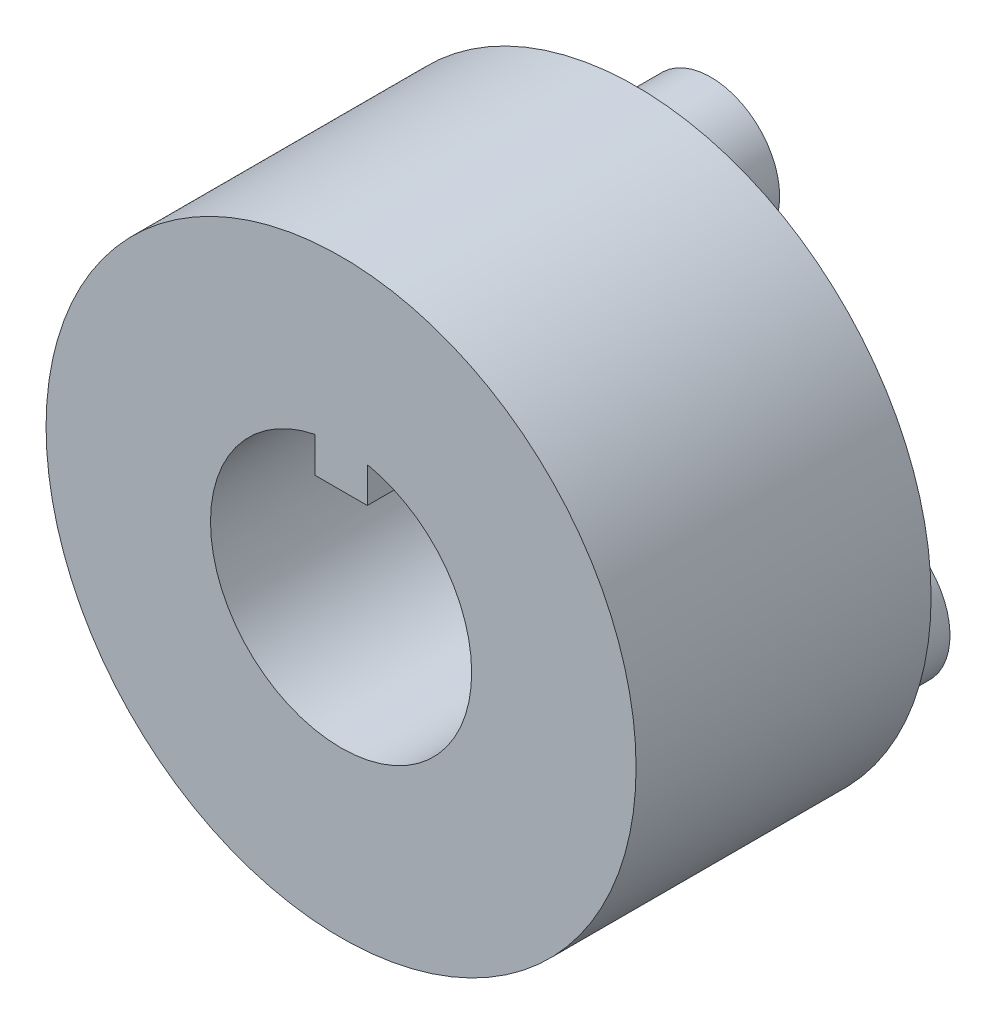
ISO-10303-21;
HEADER;
FILE_DESCRIPTION(('STEP AP214'),'2;1');
FILE_NAME('part.step','',(''),(''),'','','');
FILE_SCHEMA(('AUTOMOTIVE_DESIGN { 1 0 10303 214 1 1 1 1 }'));
ENDSEC;
DATA;
#1=APPLICATION_CONTEXT('core data for automotive mechanical design processes');
#2=APPLICATION_PROTOCOL_DEFINITION('international standard','automotive_design',2000,#1);
#3=PRODUCT_CONTEXT('',#1,'mechanical');
#4=PRODUCT('Part','Part','',(#3));
#5=PRODUCT_RELATED_PRODUCT_CATEGORY('part','',(#4));
#6=PRODUCT_DEFINITION_FORMATION('','',#4);
#7=PRODUCT_DEFINITION_CONTEXT('part definition',#1,'design');
#8=PRODUCT_DEFINITION('design','',#6,#7);
#9=PRODUCT_DEFINITION_SHAPE('','',#8);
#10=(LENGTH_UNIT() NAMED_UNIT(*) SI_UNIT(.MILLI.,.METRE.));
#11=(NAMED_UNIT(*) PLANE_ANGLE_UNIT() SI_UNIT($,.RADIAN.));
#12=(NAMED_UNIT(*) SI_UNIT($,.STERADIAN.) SOLID_ANGLE_UNIT());
#13=UNCERTAINTY_MEASURE_WITH_UNIT(LENGTH_MEASURE(1.E-05),#10,'distance_accuracy_value','');
#14=(GEOMETRIC_REPRESENTATION_CONTEXT(3) GLOBAL_UNCERTAINTY_ASSIGNED_CONTEXT((#13)) GLOBAL_UNIT_ASSIGNED_CONTEXT((#10,
#11,#12)) REPRESENTATION_CONTEXT('',''));
#15=CARTESIAN_POINT('',(0.,0.,0.));
#16=DIRECTION('',(0.,0.,1.));
#17=DIRECTION('',(1.,0.,0.));
#18=AXIS2_PLACEMENT_3D('',#15,#16,#17);
#19=CARTESIAN_POINT('',(0.,0.,0.));
#20=DIRECTION('',(0.,0.,1.));
#21=DIRECTION('',(1.,0.,0.));
#22=AXIS2_PLACEMENT_3D('',#19,#20,#21);
#23=PLANE('',#22);
#24=CARTESIAN_POINT('',(0.,0.,0.));
#25=DIRECTION('',(0.,0.,1.));
#26=DIRECTION('',(1.,0.,0.));
#27=AXIS2_PLACEMENT_3D('',#24,#25,#26);
#28=CIRCLE('',#27,15.);
#29=CARTESIAN_POINT('',(15.,0.,0.));
#30=VERTEX_POINT('',#29);
#31=EDGE_CURVE('E161',#30,#30,#28,.T.);
#32=ORIENTED_EDGE('',*,*,#31,.F.);
#33=EDGE_LOOP('',(#32));
#34=FACE_BOUND('',#33,.T.);
#35=CARTESIAN_POINT('',(0.,10.,0.));
#36=DIRECTION('',(0.,0.,1.));
#37=DIRECTION('',(1.,0.,0.));
#38=AXIS2_PLACEMENT_3D('',#35,#36,#37);
#39=CIRCLE('',#38,3.5);
#40=CARTESIAN_POINT('',(3.5,10.,0.));
#41=VERTEX_POINT('',#40);
#42=EDGE_CURVE('E11',#41,#41,#39,.F.);
#43=ORIENTED_EDGE('',*,*,#42,.F.);
#44=EDGE_LOOP('',(#43));
#45=FACE_BOUND('',#44,.T.);
#46=CARTESIAN_POINT('',(8.66025403784439,-5.,0.));
#47=DIRECTION('',(0.,0.,-1.));
#48=DIRECTION('',(-1.,0.,0.));
#49=AXIS2_PLACEMENT_3D('',#46,#47,#48);
#50=CIRCLE('',#49,3.5);
#51=CARTESIAN_POINT('',(6.10738194841974,-2.605664164108,0.));
#52=VERTEX_POINT('',#51);
#53=CARTESIAN_POINT('',(5.31026233405814,-3.986315835892,0.));
#54=VERTEX_POINT('',#53);
#55=EDGE_CURVE('E113',#52,#54,#50,.T.);
#56=ORIENTED_EDGE('',*,*,#55,.F.);
#57=CARTESIAN_POINT('',(0.,0.,0.));
#58=DIRECTION('',(0.,0.,1.));
#59=DIRECTION('',(1.,0.,0.));
#60=AXIS2_PLACEMENT_3D('',#57,#58,#59);
#61=CIRCLE('',#60,6.64);
#62=CARTESIAN_POINT('',(1.335,6.50441196419784,0.));
#63=VERTEX_POINT('',#62);
#64=EDGE_CURVE('E117',#52,#63,#61,.T.);
#65=ORIENTED_EDGE('',*,*,#64,.T.);
#66=DIRECTION('',(0.,-1.,0.));
#67=VECTOR('',#66,1.);
#68=CARTESIAN_POINT('',(1.335,6.50441196419784,0.));
#69=LINE('',#68,#67);
#70=CARTESIAN_POINT('',(1.335,4.70441196419784,0.));
#71=VERTEX_POINT('',#70);
#72=EDGE_CURVE('E140',#63,#71,#69,.T.);
#73=ORIENTED_EDGE('',*,*,#72,.T.);
#74=DIRECTION('',(-1.,0.,0.));
#75=VECTOR('',#74,1.);
#76=CARTESIAN_POINT('',(-1.335,4.70441196419784,0.));
#77=LINE('',#76,#75);
#78=CARTESIAN_POINT('',(-1.335,4.70441196419784,0.));
#79=VERTEX_POINT('',#78);
#80=EDGE_CURVE('E143',#71,#79,#77,.T.);
#81=ORIENTED_EDGE('',*,*,#80,.T.);
#82=DIRECTION('',(0.,1.,0.));
#83=VECTOR('',#82,1.);
#84=CARTESIAN_POINT('',(-1.335,6.50441196419784,0.));
#85=LINE('',#84,#83);
#86=CARTESIAN_POINT('',(-1.335,6.50441196419784,0.));
#87=VERTEX_POINT('',#86);
#88=EDGE_CURVE('E146',#79,#87,#85,.T.);
#89=ORIENTED_EDGE('',*,*,#88,.T.);
#90=CARTESIAN_POINT('',(-6.10738194841975,-2.605664164108,0.));
#91=VERTEX_POINT('',#90);
#92=EDGE_CURVE('E55',#87,#91,#61,.T.);
#93=ORIENTED_EDGE('',*,*,#92,.T.);
#94=CARTESIAN_POINT('',(-8.66025403784439,-5.,0.));
#95=DIRECTION('',(0.,0.,-1.));
#96=DIRECTION('',(-1.,0.,0.));
#97=AXIS2_PLACEMENT_3D('',#94,#95,#96);
#98=CIRCLE('',#97,3.5);
#99=CARTESIAN_POINT('',(-5.31026233405814,-3.986315835892,0.));
#100=VERTEX_POINT('',#99);
#101=EDGE_CURVE('E118',#100,#91,#98,.T.);
#102=ORIENTED_EDGE('',*,*,#101,.F.);
#103=EDGE_CURVE('E49',#100,#54,#61,.T.);
#104=ORIENTED_EDGE('',*,*,#103,.T.);
#105=EDGE_LOOP('',(#56,#65,#73,#81,#89,#93,#102,#104));
#106=FACE_BOUND('',#105,.T.);
#107=ADVANCED_FACE('F34',(#34,#45,#106),#23,.F.);
#108=CARTESIAN_POINT('',(0.,0.,15.));
#109=DIRECTION('',(0.,0.,-1.));
#110=DIRECTION('',(-1.,0.,0.));
#111=AXIS2_PLACEMENT_3D('',#108,#109,#110);
#112=CYLINDRICAL_SURFACE('',#111,15.);
#113=CARTESIAN_POINT('',(0.,0.,15.));
#114=DIRECTION('',(0.,0.,1.));
#115=DIRECTION('',(1.,0.,0.));
#116=AXIS2_PLACEMENT_3D('',#113,#114,#115);
#117=CIRCLE('',#116,15.);
#118=CARTESIAN_POINT('',(15.,0.,15.));
#119=VERTEX_POINT('',#118);
#120=EDGE_CURVE('E42',#119,#119,#117,.T.);
#121=ORIENTED_EDGE('',*,*,#120,.F.);
#122=EDGE_LOOP('',(#121));
#123=FACE_BOUND('',#122,.T.);
#124=ORIENTED_EDGE('',*,*,#31,.T.);
#125=EDGE_LOOP('',(#124));
#126=FACE_BOUND('',#125,.T.);
#127=ADVANCED_FACE('F36',(#123,#126),#112,.T.);
#128=CARTESIAN_POINT('',(0.,0.,15.));
#129=DIRECTION('',(0.,0.,1.));
#130=DIRECTION('',(1.,0.,0.));
#131=AXIS2_PLACEMENT_3D('',#128,#129,#130);
#132=PLANE('',#131);
#133=CARTESIAN_POINT('',(0.,0.,15.));
#134=DIRECTION('',(0.,0.,1.));
#135=DIRECTION('',(1.,0.,0.));
#136=AXIS2_PLACEMENT_3D('',#133,#134,#135);
#137=CIRCLE('',#136,6.64);
#138=CARTESIAN_POINT('',(-1.335,6.50441196419784,15.));
#139=VERTEX_POINT('',#138);
#140=CARTESIAN_POINT('',(1.335,6.50441196419784,15.));
#141=VERTEX_POINT('',#140);
#142=EDGE_CURVE('E138',#139,#141,#137,.T.);
#143=ORIENTED_EDGE('',*,*,#142,.F.);
#144=DIRECTION('',(0.,1.,0.));
#145=VECTOR('',#144,1.);
#146=CARTESIAN_POINT('',(-1.335,6.50441196419784,15.));
#147=LINE('',#146,#145);
#148=CARTESIAN_POINT('',(-1.335,4.70441196419784,15.));
#149=VERTEX_POINT('',#148);
#150=EDGE_CURVE('E156',#149,#139,#147,.T.);
#151=ORIENTED_EDGE('',*,*,#150,.F.);
#152=DIRECTION('',(-1.,0.,0.));
#153=VECTOR('',#152,1.);
#154=CARTESIAN_POINT('',(-1.335,4.70441196419784,15.));
#155=LINE('',#154,#153);
#156=CARTESIAN_POINT('',(1.335,4.70441196419784,15.));
#157=VERTEX_POINT('',#156);
#158=EDGE_CURVE('E153',#157,#149,#155,.T.);
#159=ORIENTED_EDGE('',*,*,#158,.F.);
#160=DIRECTION('',(0.,-1.,0.));
#161=VECTOR('',#160,1.);
#162=CARTESIAN_POINT('',(1.335,6.50441196419784,15.));
#163=LINE('',#162,#161);
#164=EDGE_CURVE('E150',#141,#157,#163,.T.);
#165=ORIENTED_EDGE('',*,*,#164,.F.);
#166=EDGE_LOOP('',(#143,#151,#159,#165));
#167=FACE_BOUND('',#166,.T.);
#168=ORIENTED_EDGE('',*,*,#120,.T.);
#169=EDGE_LOOP('',(#168));
#170=FACE_BOUND('',#169,.T.);
#171=ADVANCED_FACE('F191',(#167,#170),#132,.T.);
#172=CARTESIAN_POINT('',(0.,0.,0.));
#173=DIRECTION('',(0.,0.,1.));
#174=DIRECTION('',(1.,0.,0.));
#175=AXIS2_PLACEMENT_3D('',#172,#173,#174);
#176=CYLINDRICAL_SURFACE('',#175,6.64);
#177=ORIENTED_EDGE('',*,*,#142,.T.);
#178=DIRECTION('',(0.,0.,1.));
#179=VECTOR('',#178,1.);
#180=CARTESIAN_POINT('',(1.335,6.50441196419784,0.));
#181=LINE('',#180,#179);
#182=EDGE_CURVE('E148',#63,#141,#181,.T.);
#183=ORIENTED_EDGE('',*,*,#182,.F.);
#184=ORIENTED_EDGE('',*,*,#64,.F.);
#185=DIRECTION('',(0.,0.,1.));
#186=VECTOR('',#185,1.);
#187=CARTESIAN_POINT('',(6.10738194841974,-2.605664164108,-3.8));
#188=LINE('',#187,#186);
#189=CARTESIAN_POINT('',(6.10738194841974,-2.605664164108,-3.8));
#190=VERTEX_POINT('',#189);
#191=EDGE_CURVE('E104',#190,#52,#188,.T.);
#192=ORIENTED_EDGE('',*,*,#191,.F.);
#193=CARTESIAN_POINT('',(0.,0.,-3.8));
#194=DIRECTION('',(0.,0.,-1.));
#195=DIRECTION('',(-1.,0.,0.));
#196=AXIS2_PLACEMENT_3D('',#193,#194,#195);
#197=CIRCLE('',#196,6.64);
#198=CARTESIAN_POINT('',(5.31026233405814,-3.986315835892,-3.8));
#199=VERTEX_POINT('',#198);
#200=EDGE_CURVE('E109',#199,#190,#197,.F.);
#201=ORIENTED_EDGE('',*,*,#200,.F.);
#202=DIRECTION('',(0.,0.,1.));
#203=VECTOR('',#202,1.);
#204=CARTESIAN_POINT('',(5.31026233405814,-3.986315835892,-3.8));
#205=LINE('',#204,#203);
#206=EDGE_CURVE('E106',#199,#54,#205,.T.);
#207=ORIENTED_EDGE('',*,*,#206,.T.);
#208=ORIENTED_EDGE('',*,*,#103,.F.);
#209=DIRECTION('',(0.,0.,1.));
#210=VECTOR('',#209,1.);
#211=CARTESIAN_POINT('',(-5.31026233405814,-3.986315835892,-3.8));
#212=LINE('',#211,#210);
#213=CARTESIAN_POINT('',(-5.31026233405814,-3.986315835892,-3.8));
#214=VERTEX_POINT('',#213);
#215=EDGE_CURVE('E132',#214,#100,#212,.T.);
#216=ORIENTED_EDGE('',*,*,#215,.F.);
#217=CARTESIAN_POINT('',(0.,0.,-3.8));
#218=DIRECTION('',(0.,0.,-1.));
#219=DIRECTION('',(-1.,0.,0.));
#220=AXIS2_PLACEMENT_3D('',#217,#218,#219);
#221=CIRCLE('',#220,6.64);
#222=CARTESIAN_POINT('',(-6.10738194841974,-2.605664164108,-3.8));
#223=VERTEX_POINT('',#222);
#224=EDGE_CURVE('E120',#223,#214,#221,.F.);
#225=ORIENTED_EDGE('',*,*,#224,.F.);
#226=DIRECTION('',(0.,0.,1.));
#227=VECTOR('',#226,1.);
#228=CARTESIAN_POINT('',(-6.10738194841974,-2.605664164108,-3.8));
#229=LINE('',#228,#227);
#230=EDGE_CURVE('E128',#223,#91,#229,.T.);
#231=ORIENTED_EDGE('',*,*,#230,.T.);
#232=ORIENTED_EDGE('',*,*,#92,.F.);
#233=DIRECTION('',(0.,0.,1.));
#234=VECTOR('',#233,1.);
#235=CARTESIAN_POINT('',(-1.335,6.50441196419784,0.));
#236=LINE('',#235,#234);
#237=EDGE_CURVE('E159',#87,#139,#236,.T.);
#238=ORIENTED_EDGE('',*,*,#237,.T.);
#239=EDGE_LOOP('',(#177,#183,#184,#192,#201,#207,#208,#216,#225,#231,#232,#238));
#240=FACE_BOUND('',#239,.T.);
#241=ADVANCED_FACE('F115',(#240),#176,.F.);
#242=CARTESIAN_POINT('',(-1.335,6.50441196419784,0.));
#243=DIRECTION('',(1.,0.,0.));
#244=DIRECTION('',(0.,1.,0.));
#245=AXIS2_PLACEMENT_3D('',#242,#243,#244);
#246=PLANE('',#245);
#247=ORIENTED_EDGE('',*,*,#150,.T.);
#248=ORIENTED_EDGE('',*,*,#237,.F.);
#249=ORIENTED_EDGE('',*,*,#88,.F.);
#250=DIRECTION('',(0.,0.,1.));
#251=VECTOR('',#250,1.);
#252=CARTESIAN_POINT('',(-1.335,4.70441196419784,0.));
#253=LINE('',#252,#251);
#254=EDGE_CURVE('E162',#79,#149,#253,.T.);
#255=ORIENTED_EDGE('',*,*,#254,.T.);
#256=EDGE_LOOP('',(#247,#248,#249,#255));
#257=FACE_BOUND('',#256,.T.);
#258=ADVANCED_FACE('F185',(#257),#246,.F.);
#259=CARTESIAN_POINT('',(-1.335,4.70441196419784,0.));
#260=DIRECTION('',(0.,1.,0.));
#261=DIRECTION('',(0.,0.,1.));
#262=AXIS2_PLACEMENT_3D('',#259,#260,#261);
#263=PLANE('',#262);
#264=ORIENTED_EDGE('',*,*,#158,.T.);
#265=ORIENTED_EDGE('',*,*,#254,.F.);
#266=ORIENTED_EDGE('',*,*,#80,.F.);
#267=DIRECTION('',(0.,0.,1.));
#268=VECTOR('',#267,1.);
#269=CARTESIAN_POINT('',(1.335,4.70441196419784,0.));
#270=LINE('',#269,#268);
#271=EDGE_CURVE('E164',#71,#157,#270,.T.);
#272=ORIENTED_EDGE('',*,*,#271,.T.);
#273=EDGE_LOOP('',(#264,#265,#266,#272));
#274=FACE_BOUND('',#273,.T.);
#275=ADVANCED_FACE('F198',(#274),#263,.F.);
#276=CARTESIAN_POINT('',(1.335,6.50441196419784,0.));
#277=DIRECTION('',(-1.,0.,0.));
#278=DIRECTION('',(0.,-1.,0.));
#279=AXIS2_PLACEMENT_3D('',#276,#277,#278);
#280=PLANE('',#279);
#281=ORIENTED_EDGE('',*,*,#164,.T.);
#282=ORIENTED_EDGE('',*,*,#271,.F.);
#283=ORIENTED_EDGE('',*,*,#72,.F.);
#284=ORIENTED_EDGE('',*,*,#182,.T.);
#285=EDGE_LOOP('',(#281,#282,#283,#284));
#286=FACE_BOUND('',#285,.T.);
#287=ADVANCED_FACE('F195',(#286),#280,.F.);
#288=CARTESIAN_POINT('',(0.,10.,-3.8));
#289=DIRECTION('',(0.,0.,1.));
#290=DIRECTION('',(1.,0.,0.));
#291=AXIS2_PLACEMENT_3D('',#288,#289,#290);
#292=CYLINDRICAL_SURFACE('',#291,3.5);
#293=CARTESIAN_POINT('',(0.,10.,-3.8));
#294=DIRECTION('',(0.,0.,-1.));
#295=DIRECTION('',(-1.,0.,0.));
#296=AXIS2_PLACEMENT_3D('',#293,#294,#295);
#297=CIRCLE('',#296,3.5);
#298=CARTESIAN_POINT('',(3.5,10.,-3.8));
#299=VERTEX_POINT('',#298);
#300=EDGE_CURVE('E135',#299,#299,#297,.T.);
#301=CARTESIAN_POINT('',(3.5,10.,-3.8));
#302=CARTESIAN_POINT('',(3.5,10.,-3.76041666666667));
#303=CARTESIAN_POINT('',(3.5,10.,-3.72083333333333));
#304=CARTESIAN_POINT('',(3.5,10.,-3.64166666666667));
#305=CARTESIAN_POINT('',(3.5,10.,-3.60208333333333));
#306=CARTESIAN_POINT('',(3.5,10.,-3.52291666666667));
#307=CARTESIAN_POINT('',(3.5,10.,-3.48333333333333));
#308=CARTESIAN_POINT('',(3.5,10.,-3.40416666666667));
#309=CARTESIAN_POINT('',(3.5,10.,-3.36458333333333));
#310=CARTESIAN_POINT('',(3.5,10.,-3.28541666666667));
#311=CARTESIAN_POINT('',(3.5,10.,-3.24583333333333));
#312=CARTESIAN_POINT('',(3.5,10.,-3.16666666666667));
#313=CARTESIAN_POINT('',(3.5,10.,-3.12708333333333));
#314=CARTESIAN_POINT('',(3.5,10.,-3.04791666666667));
#315=CARTESIAN_POINT('',(3.5,10.,-3.00833333333333));
#316=CARTESIAN_POINT('',(3.5,10.,-2.92916666666667));
#317=CARTESIAN_POINT('',(3.5,10.,-2.88958333333333));
#318=CARTESIAN_POINT('',(3.5,10.,-2.81041666666667));
#319=CARTESIAN_POINT('',(3.5,10.,-2.77083333333333));
#320=CARTESIAN_POINT('',(3.5,10.,-2.69166666666667));
#321=CARTESIAN_POINT('',(3.5,10.,-2.65208333333333));
#322=CARTESIAN_POINT('',(3.5,10.,-2.57291666666667));
#323=CARTESIAN_POINT('',(3.5,10.,-2.53333333333333));
#324=CARTESIAN_POINT('',(3.5,10.,-2.45416666666667));
#325=CARTESIAN_POINT('',(3.5,10.,-2.41458333333333));
#326=CARTESIAN_POINT('',(3.5,10.,-2.33541666666667));
#327=CARTESIAN_POINT('',(3.5,10.,-2.29583333333333));
#328=CARTESIAN_POINT('',(3.5,10.,-2.21666666666667));
#329=CARTESIAN_POINT('',(3.5,10.,-2.17708333333333));
#330=CARTESIAN_POINT('',(3.5,10.,-2.09791666666667));
#331=CARTESIAN_POINT('',(3.5,10.,-2.05833333333333));
#332=CARTESIAN_POINT('',(3.5,10.,-1.97916666666667));
#333=CARTESIAN_POINT('',(3.5,10.,-1.93958333333333));
#334=CARTESIAN_POINT('',(3.5,10.,-1.86041666666667));
#335=CARTESIAN_POINT('',(3.5,10.,-1.82083333333333));
#336=CARTESIAN_POINT('',(3.5,10.,-1.74166666666667));
#337=CARTESIAN_POINT('',(3.5,10.,-1.70208333333333));
#338=CARTESIAN_POINT('',(3.5,10.,-1.62291666666667));
#339=CARTESIAN_POINT('',(3.5,10.,-1.58333333333333));
#340=CARTESIAN_POINT('',(3.5,10.,-1.50416666666667));
#341=CARTESIAN_POINT('',(3.5,10.,-1.46458333333333));
#342=CARTESIAN_POINT('',(3.5,10.,-1.38541666666667));
#343=CARTESIAN_POINT('',(3.5,10.,-1.34583333333333));
#344=CARTESIAN_POINT('',(3.5,10.,-1.26666666666667));
#345=CARTESIAN_POINT('',(3.5,10.,-1.22708333333333));
#346=CARTESIAN_POINT('',(3.5,10.,-1.14791666666667));
#347=CARTESIAN_POINT('',(3.5,10.,-1.10833333333333));
#348=CARTESIAN_POINT('',(3.5,10.,-1.02916666666667));
#349=CARTESIAN_POINT('',(3.5,10.,-0.989583333333333));
#350=CARTESIAN_POINT('',(3.5,10.,-0.910416666666667));
#351=CARTESIAN_POINT('',(3.5,10.,-0.870833333333333));
#352=CARTESIAN_POINT('',(3.5,10.,-0.791666666666667));
#353=CARTESIAN_POINT('',(3.5,10.,-0.752083333333333));
#354=CARTESIAN_POINT('',(3.5,10.,-0.672916666666667));
#355=CARTESIAN_POINT('',(3.5,10.,-0.633333333333333));
#356=CARTESIAN_POINT('',(3.5,10.,-0.554166666666667));
#357=CARTESIAN_POINT('',(3.5,10.,-0.514583333333334));
#358=CARTESIAN_POINT('',(3.5,10.,-0.435416666666667));
#359=CARTESIAN_POINT('',(3.5,10.,-0.395833333333333));
#360=CARTESIAN_POINT('',(3.5,10.,-0.316666666666666));
#361=CARTESIAN_POINT('',(3.5,10.,-0.277083333333333));
#362=CARTESIAN_POINT('',(3.5,10.,-0.197916666666667));
#363=CARTESIAN_POINT('',(3.5,10.,-0.158333333333333));
#364=CARTESIAN_POINT('',(3.5,10.,-0.0791666666666666));
#365=CARTESIAN_POINT('',(3.5,10.,-0.0395833333333333));
#366=CARTESIAN_POINT('',(3.5,10.,0.));
#367=B_SPLINE_CURVE_WITH_KNOTS('',3,(#301,#302,#303,#304,#305,#306,#307,#308,#309,#310,#311,
#312,#313,#314,#315,#316,#317,#318,#319,#320,#321,#322,#323,#324,#325,#326,#327,#328,#329,#330,
#331,#332,#333,#334,#335,#336,#337,#338,#339,#340,#341,#342,#343,#344,#345,#346,#347,#348,#349,
#350,#351,#352,#353,#354,#355,#356,#357,#358,#359,#360,#361,#362,#363,#364,#365,#366),
.UNSPECIFIED.,.F.,.F.,(4,2,2,2,2,2,2,2,2,2,2,2,2,2,2,2,2,2,2,2,2,2,2,2,2,2,2,2,2,2,2,2,4),(0.,
0.11875,0.2375,0.35625,0.475,0.59375,0.7125,0.831249999999999,0.95,1.06875,1.1875,1.30625,1.425,
1.54375,1.6625,1.78125,1.9,2.01875,2.1375,2.25625,2.375,2.49375,2.6125,2.73125,2.85,2.96875,
3.0875,3.20625,3.325,3.44375,3.5625,3.68125,3.8),.UNSPECIFIED.);
#368=EDGE_CURVE('BSEAM205',#299,#41,#367,.T.);
#369=ORIENTED_EDGE('',*,*,#300,.F.);
#370=ORIENTED_EDGE('',*,*,#42,.T.);
#371=ORIENTED_EDGE('',*,*,#368,.T.);
#372=ORIENTED_EDGE('',*,*,#368,.F.);
#373=EDGE_LOOP('',(#369,#371,#370,#372));
#374=FACE_BOUND('',#373,.T.);
#375=ADVANCED_FACE('F205',(#374),#292,.T.);
#376=CARTESIAN_POINT('',(0.,0.,-3.8));
#377=DIRECTION('',(0.,0.,-1.));
#378=DIRECTION('',(-1.,0.,0.));
#379=AXIS2_PLACEMENT_3D('',#376,#377,#378);
#380=PLANE('',#379);
#381=ORIENTED_EDGE('',*,*,#300,.T.);
#382=EDGE_LOOP('',(#381));
#383=FACE_BOUND('',#382,.T.);
#384=ADVANCED_FACE('F243',(#383),#380,.T.);
#385=CARTESIAN_POINT('',(-8.66025403784439,-5.,-3.8));
#386=DIRECTION('',(0.,0.,1.));
#387=DIRECTION('',(1.,0.,0.));
#388=AXIS2_PLACEMENT_3D('',#385,#386,#387);
#389=CYLINDRICAL_SURFACE('',#388,3.5);
#390=ORIENTED_EDGE('',*,*,#101,.T.);
#391=ORIENTED_EDGE('',*,*,#230,.F.);
#392=CARTESIAN_POINT('',(-8.66025403784439,-5.,-3.8));
#393=DIRECTION('',(0.,0.,-1.));
#394=DIRECTION('',(-1.,0.,0.));
#395=AXIS2_PLACEMENT_3D('',#392,#393,#394);
#396=CIRCLE('',#395,3.5);
#397=EDGE_CURVE('E127',#214,#223,#396,.T.);
#398=ORIENTED_EDGE('',*,*,#397,.F.);
#399=ORIENTED_EDGE('',*,*,#215,.T.);
#400=EDGE_LOOP('',(#390,#391,#398,#399));
#401=FACE_BOUND('',#400,.T.);
#402=ADVANCED_FACE('F180',(#401),#389,.T.);
#403=CARTESIAN_POINT('',(0.,0.,-3.8));
#404=DIRECTION('',(0.,0.,-1.));
#405=DIRECTION('',(-1.,0.,0.));
#406=AXIS2_PLACEMENT_3D('',#403,#404,#405);
#407=PLANE('',#406);
#408=ORIENTED_EDGE('',*,*,#224,.T.);
#409=ORIENTED_EDGE('',*,*,#397,.T.);
#410=EDGE_LOOP('',(#408,#409));
#411=FACE_BOUND('',#410,.T.);
#412=ADVANCED_FACE('F182',(#411),#407,.T.);
#413=CARTESIAN_POINT('',(8.66025403784439,-5.,-3.8));
#414=DIRECTION('',(0.,0.,1.));
#415=DIRECTION('',(1.,0.,0.));
#416=AXIS2_PLACEMENT_3D('',#413,#414,#415);
#417=CYLINDRICAL_SURFACE('',#416,3.5);
#418=ORIENTED_EDGE('',*,*,#55,.T.);
#419=ORIENTED_EDGE('',*,*,#206,.F.);
#420=CARTESIAN_POINT('',(8.66025403784439,-5.,-3.8));
#421=DIRECTION('',(0.,0.,-1.));
#422=DIRECTION('',(-1.,0.,0.));
#423=AXIS2_PLACEMENT_3D('',#420,#421,#422);
#424=CIRCLE('',#423,3.5);
#425=EDGE_CURVE('E100',#190,#199,#424,.T.);
#426=ORIENTED_EDGE('',*,*,#425,.F.);
#427=ORIENTED_EDGE('',*,*,#191,.T.);
#428=EDGE_LOOP('',(#418,#419,#426,#427));
#429=FACE_BOUND('',#428,.T.);
#430=ADVANCED_FACE('F102',(#429),#417,.T.);
#431=CARTESIAN_POINT('',(0.,0.,-3.8));
#432=DIRECTION('',(0.,0.,-1.));
#433=DIRECTION('',(-1.,0.,0.));
#434=AXIS2_PLACEMENT_3D('',#431,#432,#433);
#435=PLANE('',#434);
#436=ORIENTED_EDGE('',*,*,#200,.T.);
#437=ORIENTED_EDGE('',*,*,#425,.T.);
#438=EDGE_LOOP('',(#436,#437));
#439=FACE_BOUND('',#438,.T.);
#440=ADVANCED_FACE('F111',(#439),#435,.T.);
#441=CLOSED_SHELL('',(#107,#127,#171,#241,#258,#275,#287,#375,#384,#402,#412,#430,#440));
#442=MANIFOLD_SOLID_BREP('B2',#441);
#443=ADVANCED_BREP_SHAPE_REPRESENTATION('',(#18,#442),#14);
#444=SHAPE_DEFINITION_REPRESENTATION(#9,#443);
ENDSEC;
END-ISO-10303-21;
